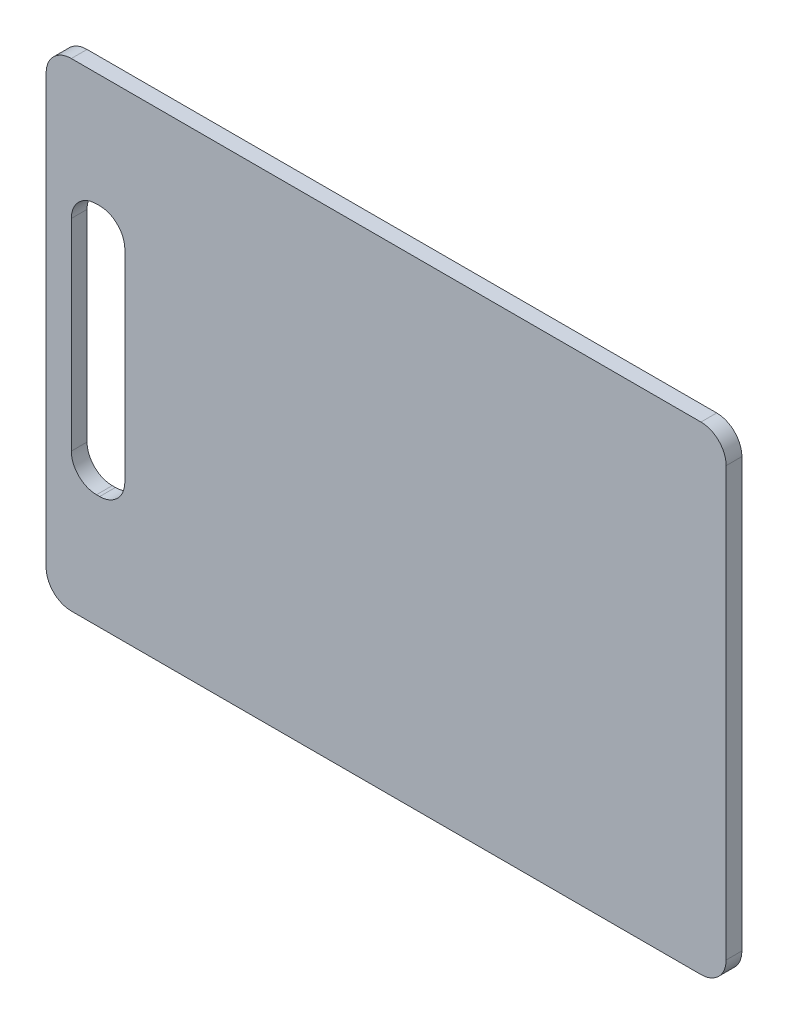
ISO-10303-21;
HEADER;
FILE_DESCRIPTION(('STEP AP214'),'2;1');
FILE_NAME('part.step','',(''),(''),'','','');
FILE_SCHEMA(('AUTOMOTIVE_DESIGN { 1 0 10303 214 1 1 1 1 }'));
ENDSEC;
DATA;
#1=APPLICATION_CONTEXT('core data for automotive mechanical design processes');
#2=APPLICATION_PROTOCOL_DEFINITION('international standard','automotive_design',2000,#1);
#3=PRODUCT_CONTEXT('',#1,'mechanical');
#4=PRODUCT('Part','Part','',(#3));
#5=PRODUCT_RELATED_PRODUCT_CATEGORY('part','',(#4));
#6=PRODUCT_DEFINITION_FORMATION('','',#4);
#7=PRODUCT_DEFINITION_CONTEXT('part definition',#1,'design');
#8=PRODUCT_DEFINITION('design','',#6,#7);
#9=PRODUCT_DEFINITION_SHAPE('','',#8);
#10=(LENGTH_UNIT() NAMED_UNIT(*) SI_UNIT(.MILLI.,.METRE.));
#11=(NAMED_UNIT(*) PLANE_ANGLE_UNIT() SI_UNIT($,.RADIAN.));
#12=(NAMED_UNIT(*) SI_UNIT($,.STERADIAN.) SOLID_ANGLE_UNIT());
#13=UNCERTAINTY_MEASURE_WITH_UNIT(LENGTH_MEASURE(1.E-05),#10,'distance_accuracy_value','');
#14=(GEOMETRIC_REPRESENTATION_CONTEXT(3) GLOBAL_UNCERTAINTY_ASSIGNED_CONTEXT((#13)) GLOBAL_UNIT_ASSIGNED_CONTEXT((#10,
#11,#12)) REPRESENTATION_CONTEXT('',''));
#15=CARTESIAN_POINT('',(0.,0.,0.));
#16=DIRECTION('',(0.,0.,1.));
#17=DIRECTION('',(1.,0.,0.));
#18=AXIS2_PLACEMENT_3D('',#15,#16,#17);
#19=CARTESIAN_POINT('',(0.,0.,7.9375));
#20=DIRECTION('',(0.,0.,1.));
#21=DIRECTION('',(1.,0.,0.));
#22=AXIS2_PLACEMENT_3D('',#19,#20,#21);
#23=PLANE('',#22);
#24=DIRECTION('',(0.,-1.,0.));
#25=VECTOR('',#24,1.);
#26=CARTESIAN_POINT('',(-342.9,241.3,7.9375));
#27=LINE('',#26,#25);
#28=CARTESIAN_POINT('',(-342.9,228.6,7.9375));
#29=VERTEX_POINT('',#28);
#30=CARTESIAN_POINT('',(-342.9,12.7,7.9375));
#31=VERTEX_POINT('',#30);
#32=EDGE_CURVE('E266',#29,#31,#27,.T.);
#33=ORIENTED_EDGE('',*,*,#32,.T.);
#34=CARTESIAN_POINT('',(-330.2,12.7,7.9375));
#35=DIRECTION('',(0.,0.,1.));
#36=DIRECTION('',(1.,0.,0.));
#37=AXIS2_PLACEMENT_3D('',#34,#35,#36);
#38=CIRCLE('',#37,12.7);
#39=CARTESIAN_POINT('',(-330.2,0.,7.9375));
#40=VERTEX_POINT('',#39);
#41=EDGE_CURVE('E215',#31,#40,#38,.T.);
#42=ORIENTED_EDGE('',*,*,#41,.T.);
#43=DIRECTION('',(1.,0.,0.));
#44=VECTOR('',#43,1.);
#45=CARTESIAN_POINT('',(-342.9,0.,7.9375));
#46=LINE('',#45,#44);
#47=CARTESIAN_POINT('',(-12.7,0.,7.9375));
#48=VERTEX_POINT('',#47);
#49=EDGE_CURVE('E269',#40,#48,#46,.T.);
#50=ORIENTED_EDGE('',*,*,#49,.T.);
#51=CARTESIAN_POINT('',(-12.7,12.7,7.9375));
#52=DIRECTION('',(0.,0.,1.));
#53=DIRECTION('',(1.,0.,0.));
#54=AXIS2_PLACEMENT_3D('',#51,#52,#53);
#55=CIRCLE('',#54,12.7);
#56=CARTESIAN_POINT('',(0.,12.7,7.9375));
#57=VERTEX_POINT('',#56);
#58=EDGE_CURVE('E213',#48,#57,#55,.T.);
#59=ORIENTED_EDGE('',*,*,#58,.T.);
#60=DIRECTION('',(0.,1.,0.));
#61=VECTOR('',#60,1.);
#62=CARTESIAN_POINT('',(0.,241.3,7.9375));
#63=LINE('',#62,#61);
#64=CARTESIAN_POINT('',(0.,228.6,7.9375));
#65=VERTEX_POINT('',#64);
#66=EDGE_CURVE('E173',#57,#65,#63,.T.);
#67=ORIENTED_EDGE('',*,*,#66,.T.);
#68=CARTESIAN_POINT('',(-12.7,228.6,7.9375));
#69=DIRECTION('',(0.,0.,1.));
#70=DIRECTION('',(1.,0.,0.));
#71=AXIS2_PLACEMENT_3D('',#68,#69,#70);
#72=CIRCLE('',#71,12.7);
#73=CARTESIAN_POINT('',(-12.7,241.3,7.9375));
#74=VERTEX_POINT('',#73);
#75=EDGE_CURVE('E55',#65,#74,#72,.T.);
#76=ORIENTED_EDGE('',*,*,#75,.T.);
#77=DIRECTION('',(-1.,0.,0.));
#78=VECTOR('',#77,1.);
#79=CARTESIAN_POINT('',(-342.9,241.3,7.9375));
#80=LINE('',#79,#78);
#81=CARTESIAN_POINT('',(-330.2,241.3,7.9375));
#82=VERTEX_POINT('',#81);
#83=EDGE_CURVE('E169',#74,#82,#80,.T.);
#84=ORIENTED_EDGE('',*,*,#83,.T.);
#85=CARTESIAN_POINT('',(-330.2,228.6,7.9375));
#86=DIRECTION('',(0.,0.,1.));
#87=DIRECTION('',(1.,0.,0.));
#88=AXIS2_PLACEMENT_3D('',#85,#86,#87);
#89=CIRCLE('',#88,12.7);
#90=EDGE_CURVE('E210',#82,#29,#89,.T.);
#91=ORIENTED_EDGE('',*,*,#90,.T.);
#92=EDGE_LOOP('',(#33,#42,#50,#59,#67,#76,#84,#91));
#93=FACE_BOUND('',#92,.T.);
#94=DIRECTION('',(1.,0.,0.));
#95=VECTOR('',#94,1.);
#96=CARTESIAN_POINT('',(-330.2,57.15,7.9375));
#97=LINE('',#96,#95);
#98=CARTESIAN_POINT('',(-317.5,57.15,7.9375));
#99=VERTEX_POINT('',#98);
#100=CARTESIAN_POINT('',(-315.9125,57.15,7.9375));
#101=VERTEX_POINT('',#100);
#102=EDGE_CURVE('E254',#99,#101,#97,.T.);
#103=ORIENTED_EDGE('',*,*,#102,.F.);
#104=CARTESIAN_POINT('',(-317.5,69.85,7.9375));
#105=DIRECTION('',(0.,0.,1.));
#106=DIRECTION('',(1.,0.,0.));
#107=AXIS2_PLACEMENT_3D('',#104,#105,#106);
#108=CIRCLE('',#107,12.7);
#109=CARTESIAN_POINT('',(-330.2,69.85,7.9375));
#110=VERTEX_POINT('',#109);
#111=EDGE_CURVE('E228',#99,#110,#108,.F.);
#112=ORIENTED_EDGE('',*,*,#111,.T.);
#113=DIRECTION('',(0.,-1.,0.));
#114=VECTOR('',#113,1.);
#115=CARTESIAN_POINT('',(-330.2,184.15,7.9375));
#116=LINE('',#115,#114);
#117=CARTESIAN_POINT('',(-330.2,171.45,7.9375));
#118=VERTEX_POINT('',#117);
#119=EDGE_CURVE('E260',#118,#110,#116,.T.);
#120=ORIENTED_EDGE('',*,*,#119,.F.);
#121=CARTESIAN_POINT('',(-317.5,171.45,7.9375));
#122=DIRECTION('',(0.,0.,1.));
#123=DIRECTION('',(1.,0.,0.));
#124=AXIS2_PLACEMENT_3D('',#121,#122,#123);
#125=CIRCLE('',#124,12.7);
#126=CARTESIAN_POINT('',(-317.5,184.15,7.9375));
#127=VERTEX_POINT('',#126);
#128=EDGE_CURVE('E11',#118,#127,#125,.F.);
#129=ORIENTED_EDGE('',*,*,#128,.T.);
#130=DIRECTION('',(-1.,0.,0.));
#131=VECTOR('',#130,1.);
#132=CARTESIAN_POINT('',(-330.2,184.15,7.9375));
#133=LINE('',#132,#131);
#134=CARTESIAN_POINT('',(-315.9125,184.15,7.9375));
#135=VERTEX_POINT('',#134);
#136=EDGE_CURVE('E245',#135,#127,#133,.T.);
#137=ORIENTED_EDGE('',*,*,#136,.F.);
#138=CARTESIAN_POINT('',(-315.9125,171.45,7.9375));
#139=DIRECTION('',(0.,0.,1.));
#140=DIRECTION('',(1.,0.,0.));
#141=AXIS2_PLACEMENT_3D('',#138,#139,#140);
#142=CIRCLE('',#141,12.7);
#143=CARTESIAN_POINT('',(-303.2125,171.45,7.9375));
#144=VERTEX_POINT('',#143);
#145=EDGE_CURVE('E156',#135,#144,#142,.F.);
#146=ORIENTED_EDGE('',*,*,#145,.T.);
#147=DIRECTION('',(0.,1.,0.));
#148=VECTOR('',#147,1.);
#149=CARTESIAN_POINT('',(-303.2125,184.15,7.9375));
#150=LINE('',#149,#148);
#151=CARTESIAN_POINT('',(-303.2125,69.85,7.9375));
#152=VERTEX_POINT('',#151);
#153=EDGE_CURVE('E242',#152,#144,#150,.T.);
#154=ORIENTED_EDGE('',*,*,#153,.F.);
#155=CARTESIAN_POINT('',(-315.9125,69.85,7.9375));
#156=DIRECTION('',(0.,0.,1.));
#157=DIRECTION('',(1.,0.,0.));
#158=AXIS2_PLACEMENT_3D('',#155,#156,#157);
#159=CIRCLE('',#158,12.7);
#160=EDGE_CURVE('E232',#152,#101,#159,.F.);
#161=ORIENTED_EDGE('',*,*,#160,.T.);
#162=EDGE_LOOP('',(#103,#112,#120,#129,#137,#146,#154,#161));
#163=FACE_BOUND('',#162,.T.);
#164=ADVANCED_FACE('F33',(#93,#163),#23,.T.);
#165=CARTESIAN_POINT('',(0.,0.,0.));
#166=DIRECTION('',(0.,0.,1.));
#167=DIRECTION('',(1.,0.,0.));
#168=AXIS2_PLACEMENT_3D('',#165,#166,#167);
#169=PLANE('',#168);
#170=DIRECTION('',(1.,0.,0.));
#171=VECTOR('',#170,1.);
#172=CARTESIAN_POINT('',(-342.9,0.,0.));
#173=LINE('',#172,#171);
#174=CARTESIAN_POINT('',(-330.2,0.,0.));
#175=VERTEX_POINT('',#174);
#176=CARTESIAN_POINT('',(-12.7,0.,0.));
#177=VERTEX_POINT('',#176);
#178=EDGE_CURVE('E276',#175,#177,#173,.T.);
#179=ORIENTED_EDGE('',*,*,#178,.F.);
#180=CARTESIAN_POINT('',(-330.2,12.7,0.));
#181=DIRECTION('',(0.,0.,1.));
#182=DIRECTION('',(1.,0.,0.));
#183=AXIS2_PLACEMENT_3D('',#180,#181,#182);
#184=CIRCLE('',#183,12.7);
#185=CARTESIAN_POINT('',(-342.9,12.7,0.));
#186=VERTEX_POINT('',#185);
#187=EDGE_CURVE('E203',#175,#186,#184,.F.);
#188=ORIENTED_EDGE('',*,*,#187,.T.);
#189=DIRECTION('',(0.,-1.,0.));
#190=VECTOR('',#189,1.);
#191=CARTESIAN_POINT('',(-342.9,241.3,0.));
#192=LINE('',#191,#190);
#193=CARTESIAN_POINT('',(-342.9,228.6,0.));
#194=VERTEX_POINT('',#193);
#195=EDGE_CURVE('E273',#194,#186,#192,.T.);
#196=ORIENTED_EDGE('',*,*,#195,.F.);
#197=CARTESIAN_POINT('',(-330.2,228.6,0.));
#198=DIRECTION('',(0.,0.,1.));
#199=DIRECTION('',(1.,0.,0.));
#200=AXIS2_PLACEMENT_3D('',#197,#198,#199);
#201=CIRCLE('',#200,12.7);
#202=CARTESIAN_POINT('',(-330.2,241.3,0.));
#203=VERTEX_POINT('',#202);
#204=EDGE_CURVE('E197',#194,#203,#201,.F.);
#205=ORIENTED_EDGE('',*,*,#204,.T.);
#206=DIRECTION('',(-1.,0.,0.));
#207=VECTOR('',#206,1.);
#208=CARTESIAN_POINT('',(-342.9,241.3,0.));
#209=LINE('',#208,#207);
#210=CARTESIAN_POINT('',(-12.7,241.3,0.));
#211=VERTEX_POINT('',#210);
#212=EDGE_CURVE('E176',#211,#203,#209,.T.);
#213=ORIENTED_EDGE('',*,*,#212,.F.);
#214=CARTESIAN_POINT('',(-12.7,228.6,0.));
#215=DIRECTION('',(0.,0.,1.));
#216=DIRECTION('',(1.,0.,0.));
#217=AXIS2_PLACEMENT_3D('',#214,#215,#216);
#218=CIRCLE('',#217,12.7);
#219=CARTESIAN_POINT('',(0.,228.6,0.));
#220=VERTEX_POINT('',#219);
#221=EDGE_CURVE('E199',#211,#220,#218,.F.);
#222=ORIENTED_EDGE('',*,*,#221,.T.);
#223=DIRECTION('',(0.,1.,0.));
#224=VECTOR('',#223,1.);
#225=CARTESIAN_POINT('',(0.,241.3,0.));
#226=LINE('',#225,#224);
#227=CARTESIAN_POINT('',(0.,12.7,0.));
#228=VERTEX_POINT('',#227);
#229=EDGE_CURVE('E278',#228,#220,#226,.T.);
#230=ORIENTED_EDGE('',*,*,#229,.F.);
#231=CARTESIAN_POINT('',(-12.7,12.7,0.));
#232=DIRECTION('',(0.,0.,1.));
#233=DIRECTION('',(1.,0.,0.));
#234=AXIS2_PLACEMENT_3D('',#231,#232,#233);
#235=CIRCLE('',#234,12.7);
#236=EDGE_CURVE('E201',#228,#177,#235,.F.);
#237=ORIENTED_EDGE('',*,*,#236,.T.);
#238=EDGE_LOOP('',(#179,#188,#196,#205,#213,#222,#230,#237));
#239=FACE_BOUND('',#238,.T.);
#240=DIRECTION('',(-1.,0.,0.));
#241=VECTOR('',#240,1.);
#242=CARTESIAN_POINT('',(-330.2,184.15,0.));
#243=LINE('',#242,#241);
#244=CARTESIAN_POINT('',(-315.9125,184.15,0.));
#245=VERTEX_POINT('',#244);
#246=CARTESIAN_POINT('',(-317.5,184.15,0.));
#247=VERTEX_POINT('',#246);
#248=EDGE_CURVE('E151',#245,#247,#243,.T.);
#249=ORIENTED_EDGE('',*,*,#248,.T.);
#250=CARTESIAN_POINT('',(-317.5,171.45,0.));
#251=DIRECTION('',(0.,0.,1.));
#252=DIRECTION('',(1.,0.,0.));
#253=AXIS2_PLACEMENT_3D('',#250,#251,#252);
#254=CIRCLE('',#253,12.7);
#255=CARTESIAN_POINT('',(-330.2,171.45,0.));
#256=VERTEX_POINT('',#255);
#257=EDGE_CURVE('E41',#247,#256,#254,.T.);
#258=ORIENTED_EDGE('',*,*,#257,.T.);
#259=DIRECTION('',(0.,-1.,0.));
#260=VECTOR('',#259,1.);
#261=CARTESIAN_POINT('',(-330.2,184.15,0.));
#262=LINE('',#261,#260);
#263=CARTESIAN_POINT('',(-330.2,69.85,0.));
#264=VERTEX_POINT('',#263);
#265=EDGE_CURVE('E149',#256,#264,#262,.T.);
#266=ORIENTED_EDGE('',*,*,#265,.T.);
#267=CARTESIAN_POINT('',(-317.5,69.85,0.));
#268=DIRECTION('',(0.,0.,1.));
#269=DIRECTION('',(1.,0.,0.));
#270=AXIS2_PLACEMENT_3D('',#267,#268,#269);
#271=CIRCLE('',#270,12.7);
#272=CARTESIAN_POINT('',(-317.5,57.15,0.));
#273=VERTEX_POINT('',#272);
#274=EDGE_CURVE('E226',#264,#273,#271,.T.);
#275=ORIENTED_EDGE('',*,*,#274,.T.);
#276=DIRECTION('',(1.,0.,0.));
#277=VECTOR('',#276,1.);
#278=CARTESIAN_POINT('',(-330.2,57.15,0.));
#279=LINE('',#278,#277);
#280=CARTESIAN_POINT('',(-315.9125,57.15,0.));
#281=VERTEX_POINT('',#280);
#282=EDGE_CURVE('E165',#273,#281,#279,.T.);
#283=ORIENTED_EDGE('',*,*,#282,.T.);
#284=CARTESIAN_POINT('',(-315.9125,69.85,0.));
#285=DIRECTION('',(0.,0.,1.));
#286=DIRECTION('',(1.,0.,0.));
#287=AXIS2_PLACEMENT_3D('',#284,#285,#286);
#288=CIRCLE('',#287,12.7);
#289=CARTESIAN_POINT('',(-303.2125,69.85,0.));
#290=VERTEX_POINT('',#289);
#291=EDGE_CURVE('E230',#281,#290,#288,.T.);
#292=ORIENTED_EDGE('',*,*,#291,.T.);
#293=DIRECTION('',(0.,1.,0.));
#294=VECTOR('',#293,1.);
#295=CARTESIAN_POINT('',(-303.2125,184.15,0.));
#296=LINE('',#295,#294);
#297=CARTESIAN_POINT('',(-303.2125,171.45,0.));
#298=VERTEX_POINT('',#297);
#299=EDGE_CURVE('E257',#290,#298,#296,.T.);
#300=ORIENTED_EDGE('',*,*,#299,.T.);
#301=CARTESIAN_POINT('',(-315.9125,171.45,0.));
#302=DIRECTION('',(0.,0.,1.));
#303=DIRECTION('',(1.,0.,0.));
#304=AXIS2_PLACEMENT_3D('',#301,#302,#303);
#305=CIRCLE('',#304,12.7);
#306=EDGE_CURVE('E234',#298,#245,#305,.T.);
#307=ORIENTED_EDGE('',*,*,#306,.T.);
#308=EDGE_LOOP('',(#249,#258,#266,#275,#283,#292,#300,#307));
#309=FACE_BOUND('',#308,.T.);
#310=ADVANCED_FACE('F148',(#239,#309),#169,.F.);
#311=CARTESIAN_POINT('',(-342.9,241.3,7.9375));
#312=DIRECTION('',(1.,0.,0.));
#313=DIRECTION('',(0.,1.,0.));
#314=AXIS2_PLACEMENT_3D('',#311,#312,#313);
#315=PLANE('',#314);
#316=ORIENTED_EDGE('',*,*,#195,.T.);
#317=DIRECTION('',(0.,0.,-1.));
#318=VECTOR('',#317,1.);
#319=CARTESIAN_POINT('',(-342.9,12.7,7.9375));
#320=LINE('',#319,#318);
#321=EDGE_CURVE('E208',#186,#31,#320,.F.);
#322=ORIENTED_EDGE('',*,*,#321,.T.);
#323=ORIENTED_EDGE('',*,*,#32,.F.);
#324=DIRECTION('',(0.,0.,-1.));
#325=VECTOR('',#324,1.);
#326=CARTESIAN_POINT('',(-342.9,228.6,7.9375));
#327=LINE('',#326,#325);
#328=EDGE_CURVE('E205',#29,#194,#327,.T.);
#329=ORIENTED_EDGE('',*,*,#328,.T.);
#330=EDGE_LOOP('',(#316,#322,#323,#329));
#331=FACE_BOUND('',#330,.T.);
#332=ADVANCED_FACE('F293',(#331),#315,.F.);
#333=CARTESIAN_POINT('',(-342.9,0.,7.9375));
#334=DIRECTION('',(0.,1.,0.));
#335=DIRECTION('',(0.,0.,1.));
#336=AXIS2_PLACEMENT_3D('',#333,#334,#335);
#337=PLANE('',#336);
#338=ORIENTED_EDGE('',*,*,#49,.F.);
#339=DIRECTION('',(0.,0.,-1.));
#340=VECTOR('',#339,1.);
#341=CARTESIAN_POINT('',(-330.2,0.,7.9375));
#342=LINE('',#341,#340);
#343=EDGE_CURVE('E194',#40,#175,#342,.T.);
#344=ORIENTED_EDGE('',*,*,#343,.T.);
#345=ORIENTED_EDGE('',*,*,#178,.T.);
#346=DIRECTION('',(0.,0.,-1.));
#347=VECTOR('',#346,1.);
#348=CARTESIAN_POINT('',(-12.7,0.,7.9375));
#349=LINE('',#348,#347);
#350=EDGE_CURVE('E192',#177,#48,#349,.F.);
#351=ORIENTED_EDGE('',*,*,#350,.T.);
#352=EDGE_LOOP('',(#338,#344,#345,#351));
#353=FACE_BOUND('',#352,.T.);
#354=ADVANCED_FACE('F302',(#353),#337,.F.);
#355=CARTESIAN_POINT('',(0.,241.3,7.9375));
#356=DIRECTION('',(-1.,0.,0.));
#357=DIRECTION('',(0.,0.,1.));
#358=AXIS2_PLACEMENT_3D('',#355,#356,#357);
#359=PLANE('',#358);
#360=ORIENTED_EDGE('',*,*,#66,.F.);
#361=DIRECTION('',(0.,0.,-1.));
#362=VECTOR('',#361,1.);
#363=CARTESIAN_POINT('',(0.,12.7,7.9375));
#364=LINE('',#363,#362);
#365=EDGE_CURVE('E219',#57,#228,#364,.T.);
#366=ORIENTED_EDGE('',*,*,#365,.T.);
#367=ORIENTED_EDGE('',*,*,#229,.T.);
#368=DIRECTION('',(0.,0.,-1.));
#369=VECTOR('',#368,1.);
#370=CARTESIAN_POINT('',(0.,228.6,7.9375));
#371=LINE('',#370,#369);
#372=EDGE_CURVE('E217',#220,#65,#371,.F.);
#373=ORIENTED_EDGE('',*,*,#372,.T.);
#374=EDGE_LOOP('',(#360,#366,#367,#373));
#375=FACE_BOUND('',#374,.T.);
#376=ADVANCED_FACE('F309',(#375),#359,.F.);
#377=CARTESIAN_POINT('',(-342.9,241.3,7.9375));
#378=DIRECTION('',(0.,-1.,0.));
#379=DIRECTION('',(0.,0.,-1.));
#380=AXIS2_PLACEMENT_3D('',#377,#378,#379);
#381=PLANE('',#380);
#382=ORIENTED_EDGE('',*,*,#83,.F.);
#383=DIRECTION('',(0.,0.,-1.));
#384=VECTOR('',#383,1.);
#385=CARTESIAN_POINT('',(-12.7,241.3,7.9375));
#386=LINE('',#385,#384);
#387=EDGE_CURVE('E223',#74,#211,#386,.T.);
#388=ORIENTED_EDGE('',*,*,#387,.T.);
#389=ORIENTED_EDGE('',*,*,#212,.T.);
#390=DIRECTION('',(0.,0.,-1.));
#391=VECTOR('',#390,1.);
#392=CARTESIAN_POINT('',(-330.2,241.3,7.9375));
#393=LINE('',#392,#391);
#394=EDGE_CURVE('E48',#203,#82,#393,.F.);
#395=ORIENTED_EDGE('',*,*,#394,.T.);
#396=EDGE_LOOP('',(#382,#388,#389,#395));
#397=FACE_BOUND('',#396,.T.);
#398=ADVANCED_FACE('F284',(#397),#381,.F.);
#399=CARTESIAN_POINT('',(-330.2,184.15,7.9375));
#400=DIRECTION('',(1.,0.,0.));
#401=DIRECTION('',(0.,0.,-1.));
#402=AXIS2_PLACEMENT_3D('',#399,#400,#401);
#403=PLANE('',#402);
#404=ORIENTED_EDGE('',*,*,#119,.T.);
#405=DIRECTION('',(0.,0.,-1.));
#406=VECTOR('',#405,1.);
#407=CARTESIAN_POINT('',(-330.2,69.85,0.));
#408=LINE('',#407,#406);
#409=EDGE_CURVE('E164',#110,#264,#408,.T.);
#410=ORIENTED_EDGE('',*,*,#409,.T.);
#411=ORIENTED_EDGE('',*,*,#265,.F.);
#412=DIRECTION('',(0.,0.,-1.));
#413=VECTOR('',#412,1.);
#414=CARTESIAN_POINT('',(-330.2,171.45,7.9375));
#415=LINE('',#414,#413);
#416=EDGE_CURVE('E161',#256,#118,#415,.F.);
#417=ORIENTED_EDGE('',*,*,#416,.T.);
#418=EDGE_LOOP('',(#404,#410,#411,#417));
#419=FACE_BOUND('',#418,.T.);
#420=ADVANCED_FACE('F160',(#419),#403,.T.);
#421=CARTESIAN_POINT('',(-330.2,57.15,7.9375));
#422=DIRECTION('',(0.,1.,0.));
#423=DIRECTION('',(0.,0.,1.));
#424=AXIS2_PLACEMENT_3D('',#421,#422,#423);
#425=PLANE('',#424);
#426=ORIENTED_EDGE('',*,*,#282,.F.);
#427=DIRECTION('',(0.,0.,-1.));
#428=VECTOR('',#427,1.);
#429=CARTESIAN_POINT('',(-317.5,57.15,7.9375));
#430=LINE('',#429,#428);
#431=EDGE_CURVE('E181',#273,#99,#430,.F.);
#432=ORIENTED_EDGE('',*,*,#431,.T.);
#433=ORIENTED_EDGE('',*,*,#102,.T.);
#434=DIRECTION('',(0.,0.,-1.));
#435=VECTOR('',#434,1.);
#436=CARTESIAN_POINT('',(-315.9125,57.15,0.));
#437=LINE('',#436,#435);
#438=EDGE_CURVE('E171',#101,#281,#437,.T.);
#439=ORIENTED_EDGE('',*,*,#438,.T.);
#440=EDGE_LOOP('',(#426,#432,#433,#439));
#441=FACE_BOUND('',#440,.T.);
#442=ADVANCED_FACE('F406',(#441),#425,.T.);
#443=CARTESIAN_POINT('',(-303.2125,184.15,7.9375));
#444=DIRECTION('',(-1.,0.,0.));
#445=DIRECTION('',(0.,0.,1.));
#446=AXIS2_PLACEMENT_3D('',#443,#444,#445);
#447=PLANE('',#446);
#448=ORIENTED_EDGE('',*,*,#299,.F.);
#449=DIRECTION('',(0.,0.,-1.));
#450=VECTOR('',#449,1.);
#451=CARTESIAN_POINT('',(-303.2125,69.85,7.9375));
#452=LINE('',#451,#450);
#453=EDGE_CURVE('E186',#290,#152,#452,.F.);
#454=ORIENTED_EDGE('',*,*,#453,.T.);
#455=ORIENTED_EDGE('',*,*,#153,.T.);
#456=DIRECTION('',(0.,0.,-1.));
#457=VECTOR('',#456,1.);
#458=CARTESIAN_POINT('',(-303.2125,171.45,0.));
#459=LINE('',#458,#457);
#460=EDGE_CURVE('E183',#144,#298,#459,.T.);
#461=ORIENTED_EDGE('',*,*,#460,.T.);
#462=EDGE_LOOP('',(#448,#454,#455,#461));
#463=FACE_BOUND('',#462,.T.);
#464=ADVANCED_FACE('F251',(#463),#447,.T.);
#465=CARTESIAN_POINT('',(-330.2,184.15,7.9375));
#466=DIRECTION('',(0.,-1.,0.));
#467=DIRECTION('',(0.,0.,-1.));
#468=AXIS2_PLACEMENT_3D('',#465,#466,#467);
#469=PLANE('',#468);
#470=ORIENTED_EDGE('',*,*,#248,.F.);
#471=DIRECTION('',(0.,0.,-1.));
#472=VECTOR('',#471,1.);
#473=CARTESIAN_POINT('',(-315.9125,184.15,7.9375));
#474=LINE('',#473,#472);
#475=EDGE_CURVE('E190',#245,#135,#474,.F.);
#476=ORIENTED_EDGE('',*,*,#475,.T.);
#477=ORIENTED_EDGE('',*,*,#136,.T.);
#478=DIRECTION('',(0.,0.,-1.));
#479=VECTOR('',#478,1.);
#480=CARTESIAN_POINT('',(-317.5,184.15,0.));
#481=LINE('',#480,#479);
#482=EDGE_CURVE('E188',#127,#247,#481,.T.);
#483=ORIENTED_EDGE('',*,*,#482,.T.);
#484=EDGE_LOOP('',(#470,#476,#477,#483));
#485=FACE_BOUND('',#484,.T.);
#486=ADVANCED_FACE('F259',(#485),#469,.T.);
#487=CARTESIAN_POINT('',(-317.5,69.85,7.9375));
#488=DIRECTION('',(0.,0.,1.));
#489=DIRECTION('',(1.,0.,0.));
#490=AXIS2_PLACEMENT_3D('',#487,#488,#489);
#491=CYLINDRICAL_SURFACE('',#490,12.7);
#492=ORIENTED_EDGE('',*,*,#111,.F.);
#493=ORIENTED_EDGE('',*,*,#431,.F.);
#494=ORIENTED_EDGE('',*,*,#274,.F.);
#495=ORIENTED_EDGE('',*,*,#409,.F.);
#496=EDGE_LOOP('',(#492,#493,#494,#495));
#497=FACE_BOUND('',#496,.T.);
#498=ADVANCED_FACE('F328',(#497),#491,.F.);
#499=CARTESIAN_POINT('',(-315.9125,69.85,7.9375));
#500=DIRECTION('',(0.,0.,1.));
#501=DIRECTION('',(1.,0.,0.));
#502=AXIS2_PLACEMENT_3D('',#499,#500,#501);
#503=CYLINDRICAL_SURFACE('',#502,12.7);
#504=ORIENTED_EDGE('',*,*,#160,.F.);
#505=ORIENTED_EDGE('',*,*,#453,.F.);
#506=ORIENTED_EDGE('',*,*,#291,.F.);
#507=ORIENTED_EDGE('',*,*,#438,.F.);
#508=EDGE_LOOP('',(#504,#505,#506,#507));
#509=FACE_BOUND('',#508,.T.);
#510=ADVANCED_FACE('F331',(#509),#503,.F.);
#511=CARTESIAN_POINT('',(-315.9125,171.45,7.9375));
#512=DIRECTION('',(0.,0.,1.));
#513=DIRECTION('',(1.,0.,0.));
#514=AXIS2_PLACEMENT_3D('',#511,#512,#513);
#515=CYLINDRICAL_SURFACE('',#514,12.7);
#516=ORIENTED_EDGE('',*,*,#145,.F.);
#517=ORIENTED_EDGE('',*,*,#475,.F.);
#518=ORIENTED_EDGE('',*,*,#306,.F.);
#519=ORIENTED_EDGE('',*,*,#460,.F.);
#520=EDGE_LOOP('',(#516,#517,#518,#519));
#521=FACE_BOUND('',#520,.T.);
#522=ADVANCED_FACE('F256',(#521),#515,.F.);
#523=CARTESIAN_POINT('',(-317.5,171.45,7.9375));
#524=DIRECTION('',(0.,0.,1.));
#525=DIRECTION('',(1.,0.,0.));
#526=AXIS2_PLACEMENT_3D('',#523,#524,#525);
#527=CYLINDRICAL_SURFACE('',#526,12.7);
#528=ORIENTED_EDGE('',*,*,#128,.F.);
#529=ORIENTED_EDGE('',*,*,#416,.F.);
#530=ORIENTED_EDGE('',*,*,#257,.F.);
#531=ORIENTED_EDGE('',*,*,#482,.F.);
#532=EDGE_LOOP('',(#528,#529,#530,#531));
#533=FACE_BOUND('',#532,.T.);
#534=ADVANCED_FACE('F168',(#533),#527,.F.);
#535=CARTESIAN_POINT('',(-330.2,12.7,7.9375));
#536=DIRECTION('',(0.,0.,-1.));
#537=DIRECTION('',(-1.,0.,0.));
#538=AXIS2_PLACEMENT_3D('',#535,#536,#537);
#539=CYLINDRICAL_SURFACE('',#538,12.7);
#540=ORIENTED_EDGE('',*,*,#41,.F.);
#541=ORIENTED_EDGE('',*,*,#321,.F.);
#542=ORIENTED_EDGE('',*,*,#187,.F.);
#543=ORIENTED_EDGE('',*,*,#343,.F.);
#544=EDGE_LOOP('',(#540,#541,#542,#543));
#545=FACE_BOUND('',#544,.T.);
#546=ADVANCED_FACE('F297',(#545),#539,.T.);
#547=CARTESIAN_POINT('',(-12.7,12.7,7.9375));
#548=DIRECTION('',(0.,0.,-1.));
#549=DIRECTION('',(-1.,0.,0.));
#550=AXIS2_PLACEMENT_3D('',#547,#548,#549);
#551=CYLINDRICAL_SURFACE('',#550,12.7);
#552=ORIENTED_EDGE('',*,*,#58,.F.);
#553=ORIENTED_EDGE('',*,*,#350,.F.);
#554=ORIENTED_EDGE('',*,*,#236,.F.);
#555=ORIENTED_EDGE('',*,*,#365,.F.);
#556=EDGE_LOOP('',(#552,#553,#554,#555));
#557=FACE_BOUND('',#556,.T.);
#558=ADVANCED_FACE('F306',(#557),#551,.T.);
#559=CARTESIAN_POINT('',(-12.7,228.6,7.9375));
#560=DIRECTION('',(0.,0.,-1.));
#561=DIRECTION('',(-1.,0.,0.));
#562=AXIS2_PLACEMENT_3D('',#559,#560,#561);
#563=CYLINDRICAL_SURFACE('',#562,12.7);
#564=ORIENTED_EDGE('',*,*,#75,.F.);
#565=ORIENTED_EDGE('',*,*,#372,.F.);
#566=ORIENTED_EDGE('',*,*,#221,.F.);
#567=ORIENTED_EDGE('',*,*,#387,.F.);
#568=EDGE_LOOP('',(#564,#565,#566,#567));
#569=FACE_BOUND('',#568,.T.);
#570=ADVANCED_FACE('F311',(#569),#563,.T.);
#571=CARTESIAN_POINT('',(-330.2,228.6,7.9375));
#572=DIRECTION('',(0.,0.,-1.));
#573=DIRECTION('',(-1.,0.,0.));
#574=AXIS2_PLACEMENT_3D('',#571,#572,#573);
#575=CYLINDRICAL_SURFACE('',#574,12.7);
#576=ORIENTED_EDGE('',*,*,#90,.F.);
#577=ORIENTED_EDGE('',*,*,#394,.F.);
#578=ORIENTED_EDGE('',*,*,#204,.F.);
#579=ORIENTED_EDGE('',*,*,#328,.F.);
#580=EDGE_LOOP('',(#576,#577,#578,#579));
#581=FACE_BOUND('',#580,.T.);
#582=ADVANCED_FACE('F35',(#581),#575,.T.);
#583=CLOSED_SHELL('',(#164,#310,#332,#354,#376,#398,#420,#442,#464,#486,#498,#510,#522,#534,
#546,#558,#570,#582));
#584=MANIFOLD_SOLID_BREP('B2',#583);
#585=ADVANCED_BREP_SHAPE_REPRESENTATION('',(#18,#584),#14);
#586=SHAPE_DEFINITION_REPRESENTATION(#9,#585);
ENDSEC;
END-ISO-10303-21;
